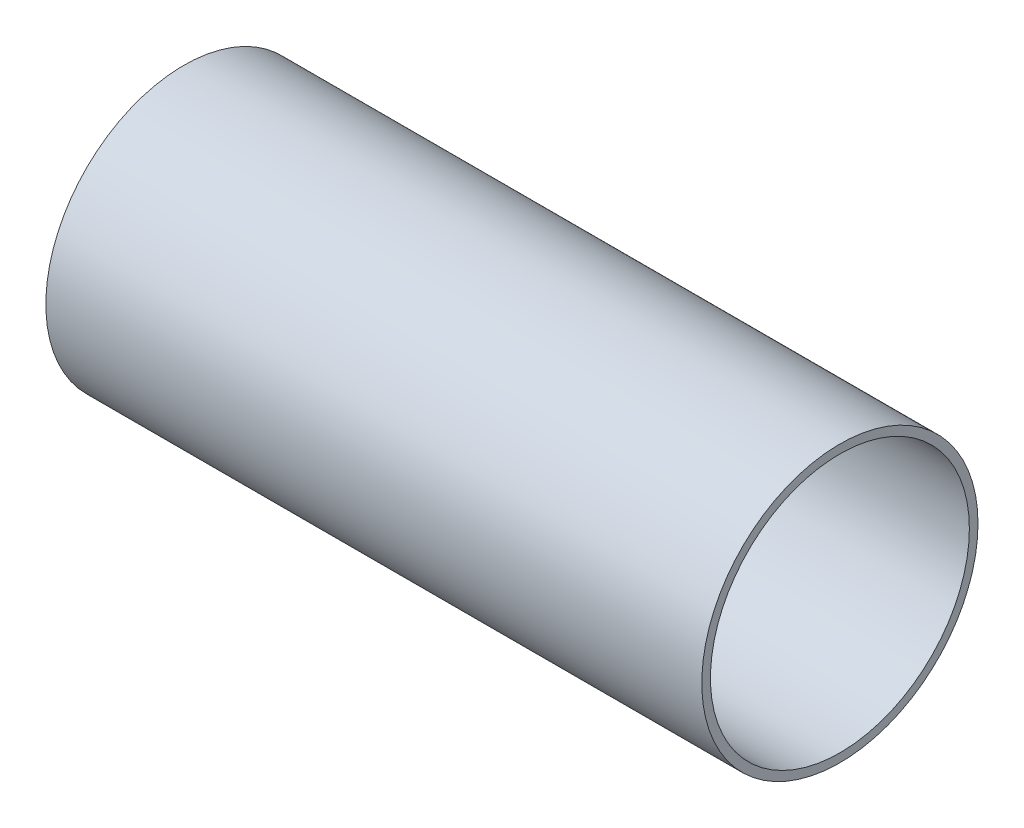
ISO-10303-21;
HEADER;
FILE_DESCRIPTION(('STEP AP214'),'2;1');
FILE_NAME('part.step','',(''),(''),'','','');
FILE_SCHEMA(('AUTOMOTIVE_DESIGN { 1 0 10303 214 1 1 1 1 }'));
ENDSEC;
DATA;
#1=APPLICATION_CONTEXT('core data for automotive mechanical design processes');
#2=APPLICATION_PROTOCOL_DEFINITION('international standard','automotive_design',2000,#1);
#3=PRODUCT_CONTEXT('',#1,'mechanical');
#4=PRODUCT('Part','Part','',(#3));
#5=PRODUCT_RELATED_PRODUCT_CATEGORY('part','',(#4));
#6=PRODUCT_DEFINITION_FORMATION('','',#4);
#7=PRODUCT_DEFINITION_CONTEXT('part definition',#1,'design');
#8=PRODUCT_DEFINITION('design','',#6,#7);
#9=PRODUCT_DEFINITION_SHAPE('','',#8);
#10=(LENGTH_UNIT() NAMED_UNIT(*) SI_UNIT(.MILLI.,.METRE.));
#11=(NAMED_UNIT(*) PLANE_ANGLE_UNIT() SI_UNIT($,.RADIAN.));
#12=(NAMED_UNIT(*) SI_UNIT($,.STERADIAN.) SOLID_ANGLE_UNIT());
#13=UNCERTAINTY_MEASURE_WITH_UNIT(LENGTH_MEASURE(1.E-05),#10,'distance_accuracy_value','');
#14=(GEOMETRIC_REPRESENTATION_CONTEXT(3) GLOBAL_UNCERTAINTY_ASSIGNED_CONTEXT((#13)) GLOBAL_UNIT_ASSIGNED_CONTEXT((#10,
#11,#12)) REPRESENTATION_CONTEXT('',''));
#15=CARTESIAN_POINT('',(0.,0.,0.));
#16=DIRECTION('',(0.,0.,1.));
#17=DIRECTION('',(1.,0.,0.));
#18=AXIS2_PLACEMENT_3D('',#15,#16,#17);
#19=CARTESIAN_POINT('',(482.6,0.,0.));
#20=DIRECTION('',(1.,0.,0.));
#21=DIRECTION('',(0.,0.,-1.));
#22=AXIS2_PLACEMENT_3D('',#19,#20,#21);
#23=PLANE('',#22);
#24=CARTESIAN_POINT('',(482.6,0.,0.));
#25=DIRECTION('',(1.,0.,0.));
#26=DIRECTION('',(0.,0.,-1.));
#27=AXIS2_PLACEMENT_3D('',#24,#25,#26);
#28=CIRCLE('',#27,101.6);
#29=CARTESIAN_POINT('',(482.6,0.,-101.6));
#30=VERTEX_POINT('',#29);
#31=EDGE_CURVE('E10',#30,#30,#28,.T.);
#32=ORIENTED_EDGE('',*,*,#31,.T.);
#33=EDGE_LOOP('',(#32));
#34=FACE_BOUND('',#33,.T.);
#35=CARTESIAN_POINT('',(482.6,0.,0.));
#36=DIRECTION('',(1.,0.,0.));
#37=DIRECTION('',(0.,0.,-1.));
#38=AXIS2_PLACEMENT_3D('',#35,#36,#37);
#39=CIRCLE('',#38,95.25);
#40=CARTESIAN_POINT('',(482.6,0.,-95.25));
#41=VERTEX_POINT('',#40);
#42=EDGE_CURVE('E42',#41,#41,#39,.T.);
#43=ORIENTED_EDGE('',*,*,#42,.F.);
#44=EDGE_LOOP('',(#43));
#45=FACE_BOUND('',#44,.T.);
#46=ADVANCED_FACE('F31',(#34,#45),#23,.T.);
#47=CARTESIAN_POINT('',(0.,0.,0.));
#48=DIRECTION('',(1.,0.,0.));
#49=DIRECTION('',(0.,0.,-1.));
#50=AXIS2_PLACEMENT_3D('',#47,#48,#49);
#51=PLANE('',#50);
#52=CARTESIAN_POINT('',(0.,0.,0.));
#53=DIRECTION('',(1.,0.,0.));
#54=DIRECTION('',(0.,0.,-1.));
#55=AXIS2_PLACEMENT_3D('',#52,#53,#54);
#56=CIRCLE('',#55,101.6);
#57=CARTESIAN_POINT('',(0.,0.,-101.6));
#58=VERTEX_POINT('',#57);
#59=EDGE_CURVE('E35',#58,#58,#56,.T.);
#60=ORIENTED_EDGE('',*,*,#59,.F.);
#61=EDGE_LOOP('',(#60));
#62=FACE_BOUND('',#61,.T.);
#63=CARTESIAN_POINT('',(0.,0.,0.));
#64=DIRECTION('',(1.,0.,0.));
#65=DIRECTION('',(0.,0.,-1.));
#66=AXIS2_PLACEMENT_3D('',#63,#64,#65);
#67=CIRCLE('',#66,95.25);
#68=CARTESIAN_POINT('',(0.,0.,-95.25));
#69=VERTEX_POINT('',#68);
#70=EDGE_CURVE('E44',#69,#69,#67,.T.);
#71=ORIENTED_EDGE('',*,*,#70,.T.);
#72=EDGE_LOOP('',(#71));
#73=FACE_BOUND('',#72,.T.);
#74=ADVANCED_FACE('F54',(#62,#73),#51,.F.);
#75=CARTESIAN_POINT('',(482.6,0.,0.));
#76=DIRECTION('',(-1.,0.,0.));
#77=DIRECTION('',(0.,0.,1.));
#78=AXIS2_PLACEMENT_3D('',#75,#76,#77);
#79=CYLINDRICAL_SURFACE('',#78,101.6);
#80=ORIENTED_EDGE('',*,*,#31,.F.);
#81=EDGE_LOOP('',(#80));
#82=FACE_BOUND('',#81,.T.);
#83=ORIENTED_EDGE('',*,*,#59,.T.);
#84=EDGE_LOOP('',(#83));
#85=FACE_BOUND('',#84,.T.);
#86=ADVANCED_FACE('F33',(#82,#85),#79,.T.);
#87=CARTESIAN_POINT('',(482.6,0.,0.));
#88=DIRECTION('',(-1.,0.,0.));
#89=DIRECTION('',(0.,0.,1.));
#90=AXIS2_PLACEMENT_3D('',#87,#88,#89);
#91=CYLINDRICAL_SURFACE('',#90,95.25);
#92=ORIENTED_EDGE('',*,*,#42,.T.);
#93=EDGE_LOOP('',(#92));
#94=FACE_BOUND('',#93,.T.);
#95=ORIENTED_EDGE('',*,*,#70,.F.);
#96=EDGE_LOOP('',(#95));
#97=FACE_BOUND('',#96,.T.);
#98=ADVANCED_FACE('F50',(#94,#97),#91,.F.);
#99=CLOSED_SHELL('',(#46,#74,#86,#98));
#100=MANIFOLD_SOLID_BREP('B2',#99);
#101=ADVANCED_BREP_SHAPE_REPRESENTATION('',(#18,#100),#14);
#102=SHAPE_DEFINITION_REPRESENTATION(#9,#101);
ENDSEC;
END-ISO-10303-21;
